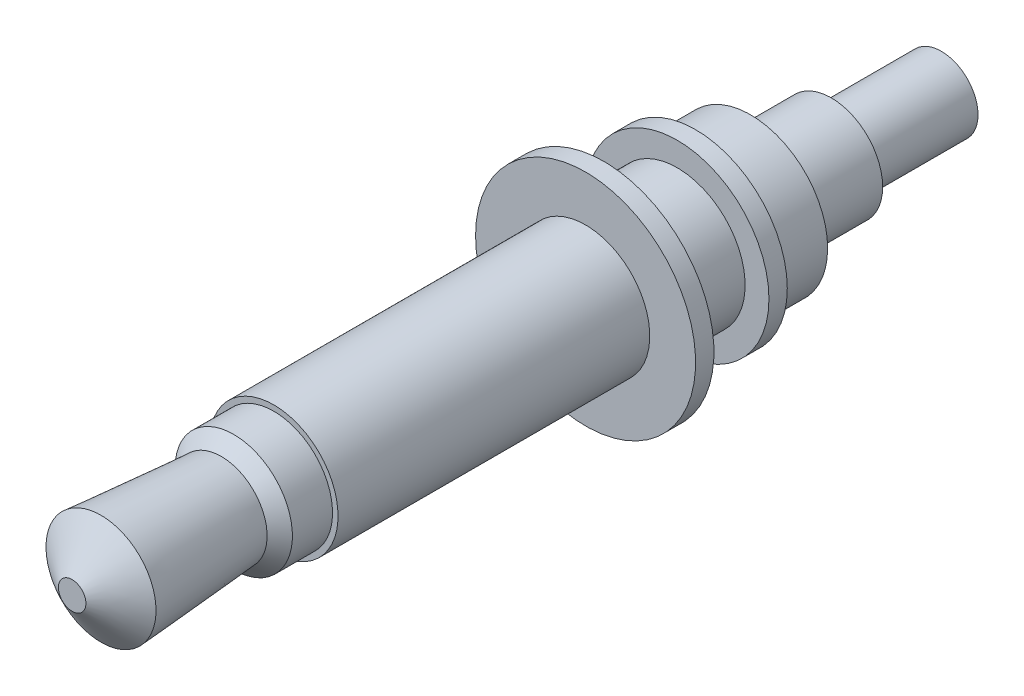
ISO-10303-21;
HEADER;
FILE_DESCRIPTION(('STEP AP214'),'2;1');
FILE_NAME('part.step','',(''),(''),'','','');
FILE_SCHEMA(('AUTOMOTIVE_DESIGN { 1 0 10303 214 1 1 1 1 }'));
ENDSEC;
DATA;
#1=APPLICATION_CONTEXT('core data for automotive mechanical design processes');
#2=APPLICATION_PROTOCOL_DEFINITION('international standard','automotive_design',2000,#1);
#3=PRODUCT_CONTEXT('',#1,'mechanical');
#4=PRODUCT('Part','Part','',(#3));
#5=PRODUCT_RELATED_PRODUCT_CATEGORY('part','',(#4));
#6=PRODUCT_DEFINITION_FORMATION('','',#4);
#7=PRODUCT_DEFINITION_CONTEXT('part definition',#1,'design');
#8=PRODUCT_DEFINITION('design','',#6,#7);
#9=PRODUCT_DEFINITION_SHAPE('','',#8);
#10=(LENGTH_UNIT() NAMED_UNIT(*) SI_UNIT(.MILLI.,.METRE.));
#11=(NAMED_UNIT(*) PLANE_ANGLE_UNIT() SI_UNIT($,.RADIAN.));
#12=(NAMED_UNIT(*) SI_UNIT($,.STERADIAN.) SOLID_ANGLE_UNIT());
#13=UNCERTAINTY_MEASURE_WITH_UNIT(LENGTH_MEASURE(1.E-05),#10,'distance_accuracy_value','');
#14=(GEOMETRIC_REPRESENTATION_CONTEXT(3) GLOBAL_UNCERTAINTY_ASSIGNED_CONTEXT((#13)) GLOBAL_UNIT_ASSIGNED_CONTEXT((#10,
#11,#12)) REPRESENTATION_CONTEXT('',''));
#15=CARTESIAN_POINT('',(0.,0.,0.));
#16=DIRECTION('',(0.,0.,1.));
#17=DIRECTION('',(1.,0.,0.));
#18=AXIS2_PLACEMENT_3D('',#15,#16,#17);
#19=CARTESIAN_POINT('',(-0.209678248509967,-0.580395581371084,46.8096666229695));
#20=DIRECTION('',(0.,0.,-1.));
#21=DIRECTION('',(-1.,0.,0.));
#22=AXIS2_PLACEMENT_3D('',#19,#20,#21);
#23=PLANE('',#22);
#24=CARTESIAN_POINT('',(-0.209678248509966,-0.580395581371085,46.8096666229695));
#25=DIRECTION('',(0.,0.,1.));
#26=DIRECTION('',(1.,0.,0.));
#27=AXIS2_PLACEMENT_3D('',#24,#25,#26);
#28=CIRCLE('',#27,1.);
#29=CARTESIAN_POINT('',(0.790321751490033,-0.580395581371085,46.8096666229695));
#30=VERTEX_POINT('',#29);
#31=EDGE_CURVE('E18',#30,#30,#28,.T.);
#32=ORIENTED_EDGE('',*,*,#31,.F.);
#33=EDGE_LOOP('',(#32));
#34=FACE_BOUND('',#33,.T.);
#35=ADVANCED_FACE('F15',(#34),#23,.T.);
#36=CARTESIAN_POINT('',(-0.209678248509957,-0.580395581371091,42.8498686483249));
#37=DIRECTION('',(0.,0.,1.));
#38=DIRECTION('',(1.,0.,0.));
#39=AXIS2_PLACEMENT_3D('',#36,#37,#38);
#40=CYLINDRICAL_SURFACE('',#39,1.);
#41=ORIENTED_EDGE('',*,*,#31,.T.);
#42=EDGE_LOOP('',(#41));
#43=FACE_BOUND('',#42,.T.);
#44=CARTESIAN_POINT('',(-0.209678248509973,-0.58039558137108,49.8096666229695));
#45=DIRECTION('',(0.,0.,1.));
#46=DIRECTION('',(1.,0.,0.));
#47=AXIS2_PLACEMENT_3D('',#44,#45,#46);
#48=CIRCLE('',#47,1.);
#49=CARTESIAN_POINT('',(0.790321751490026,-0.58039558137108,49.8096666229695));
#50=VERTEX_POINT('',#49);
#51=EDGE_CURVE('E84',#50,#50,#48,.T.);
#52=ORIENTED_EDGE('',*,*,#51,.F.);
#53=EDGE_LOOP('',(#52));
#54=FACE_BOUND('',#53,.T.);
#55=ADVANCED_FACE('F93',(#43,#54),#40,.T.);
#56=CARTESIAN_POINT('',(-0.209678248509974,-0.580395581371081,49.8096666229695));
#57=DIRECTION('',(0.,0.,-1.));
#58=DIRECTION('',(-1.,0.,0.));
#59=AXIS2_PLACEMENT_3D('',#56,#57,#58);
#60=PLANE('',#59);
#61=CARTESIAN_POINT('',(-0.209678248509974,-0.58039558137108,49.8096666229695));
#62=DIRECTION('',(0.,0.,1.));
#63=DIRECTION('',(1.,0.,0.));
#64=AXIS2_PLACEMENT_3D('',#61,#62,#63);
#65=CIRCLE('',#64,1.4);
#66=CARTESIAN_POINT('',(1.19032175149003,-0.58039558137108,49.8096666229695));
#67=VERTEX_POINT('',#66);
#68=EDGE_CURVE('E81',#67,#67,#65,.T.);
#69=ORIENTED_EDGE('',*,*,#68,.F.);
#70=EDGE_LOOP('',(#69));
#71=FACE_BOUND('',#70,.T.);
#72=ORIENTED_EDGE('',*,*,#51,.T.);
#73=EDGE_LOOP('',(#72));
#74=FACE_BOUND('',#73,.T.);
#75=ADVANCED_FACE('F100',(#71,#74),#60,.T.);
#76=CARTESIAN_POINT('',(-0.209678248509953,-0.580395581371095,40.8699696610025));
#77=DIRECTION('',(0.,0.,1.));
#78=DIRECTION('',(1.,0.,0.));
#79=AXIS2_PLACEMENT_3D('',#76,#77,#78);
#80=CYLINDRICAL_SURFACE('',#79,1.4);
#81=ORIENTED_EDGE('',*,*,#68,.T.);
#82=EDGE_LOOP('',(#81));
#83=FACE_BOUND('',#82,.T.);
#84=CARTESIAN_POINT('',(-0.20967824850998,-0.580395581371077,52.0096666229695));
#85=DIRECTION('',(0.,0.,1.));
#86=DIRECTION('',(1.,0.,0.));
#87=AXIS2_PLACEMENT_3D('',#84,#85,#86);
#88=CIRCLE('',#87,1.4);
#89=CARTESIAN_POINT('',(1.19032175149002,-0.580395581371077,52.0096666229695));
#90=VERTEX_POINT('',#89);
#91=EDGE_CURVE('E77',#90,#90,#88,.T.);
#92=ORIENTED_EDGE('',*,*,#91,.F.);
#93=EDGE_LOOP('',(#92));
#94=FACE_BOUND('',#93,.T.);
#95=ADVANCED_FACE('F166',(#83,#94),#80,.T.);
#96=CARTESIAN_POINT('',(-0.20967824850998,-0.580395581371076,52.0096666229695));
#97=DIRECTION('',(0.,0.,-1.));
#98=DIRECTION('',(-1.,0.,0.));
#99=AXIS2_PLACEMENT_3D('',#96,#97,#98);
#100=PLANE('',#99);
#101=CARTESIAN_POINT('',(-0.20967824850998,-0.580395581371076,52.0096666229695));
#102=DIRECTION('',(0.,0.,1.));
#103=DIRECTION('',(1.,0.,0.));
#104=AXIS2_PLACEMENT_3D('',#101,#102,#103);
#105=CIRCLE('',#104,2.1);
#106=CARTESIAN_POINT('',(1.89032175149002,-0.580395581371076,52.0096666229695));
#107=VERTEX_POINT('',#106);
#108=EDGE_CURVE('E73',#107,#107,#105,.T.);
#109=ORIENTED_EDGE('',*,*,#108,.F.);
#110=EDGE_LOOP('',(#109));
#111=FACE_BOUND('',#110,.T.);
#112=ORIENTED_EDGE('',*,*,#91,.T.);
#113=EDGE_LOOP('',(#112));
#114=FACE_BOUND('',#113,.T.);
#115=ADVANCED_FACE('F162',(#111,#114),#100,.T.);
#116=CARTESIAN_POINT('',(-0.20967824850998,-0.580395581371076,52.0096666229695));
#117=DIRECTION('',(0.,0.,1.));
#118=DIRECTION('',(1.,0.,0.));
#119=AXIS2_PLACEMENT_3D('',#116,#117,#118);
#120=CYLINDRICAL_SURFACE('',#119,2.1);
#121=ORIENTED_EDGE('',*,*,#108,.T.);
#122=EDGE_LOOP('',(#121));
#123=FACE_BOUND('',#122,.T.);
#124=CARTESIAN_POINT('',(-0.209678248509983,-0.580395581371073,53.5096666229695));
#125=DIRECTION('',(0.,0.,1.));
#126=DIRECTION('',(1.,0.,0.));
#127=AXIS2_PLACEMENT_3D('',#124,#125,#126);
#128=CIRCLE('',#127,2.1);
#129=CARTESIAN_POINT('',(1.89032175149002,-0.580395581371073,53.5096666229695));
#130=VERTEX_POINT('',#129);
#131=EDGE_CURVE('E70',#130,#130,#128,.T.);
#132=ORIENTED_EDGE('',*,*,#131,.F.);
#133=EDGE_LOOP('',(#132));
#134=FACE_BOUND('',#133,.T.);
#135=ADVANCED_FACE('F158',(#123,#134),#120,.T.);
#136=CARTESIAN_POINT('',(-0.209678248509983,-0.580395581371074,53.5096666229695));
#137=DIRECTION('',(0.,0.,-1.));
#138=DIRECTION('',(-1.,0.,0.));
#139=AXIS2_PLACEMENT_3D('',#136,#137,#138);
#140=PLANE('',#139);
#141=CARTESIAN_POINT('',(-0.209678248509983,-0.580395581371074,53.5096666229695));
#142=DIRECTION('',(0.,0.,1.));
#143=DIRECTION('',(1.,0.,0.));
#144=AXIS2_PLACEMENT_3D('',#141,#142,#143);
#145=CIRCLE('',#144,2.5);
#146=CARTESIAN_POINT('',(2.29032175149002,-0.580395581371074,53.5096666229695));
#147=VERTEX_POINT('',#146);
#148=EDGE_CURVE('E66',#147,#147,#145,.T.);
#149=ORIENTED_EDGE('',*,*,#148,.F.);
#150=EDGE_LOOP('',(#149));
#151=FACE_BOUND('',#150,.T.);
#152=ORIENTED_EDGE('',*,*,#131,.T.);
#153=EDGE_LOOP('',(#152));
#154=FACE_BOUND('',#153,.T.);
#155=ADVANCED_FACE('F154',(#151,#154),#140,.T.);
#156=CARTESIAN_POINT('',(-0.209678248510023,-0.580395581371046,70.5096666229695));
#157=DIRECTION('',(0.,0.,-1.));
#158=DIRECTION('',(-1.,0.,0.));
#159=AXIS2_PLACEMENT_3D('',#156,#157,#158);
#160=PLANE('',#159);
#161=CARTESIAN_POINT('',(-0.209678248510028,-0.580395581371047,70.5096666230587));
#162=DIRECTION('',(0.,0.,-1.));
#163=DIRECTION('',(-1.,0.,0.));
#164=AXIS2_PLACEMENT_3D('',#161,#162,#163);
#165=CIRCLE('',#164,0.374999999953724);
#166=CARTESIAN_POINT('',(-0.584678248463752,-0.580395581371047,70.5096666230587));
#167=VERTEX_POINT('',#166);
#168=EDGE_CURVE('E62',#167,#167,#165,.T.);
#169=ORIENTED_EDGE('',*,*,#168,.F.);
#170=EDGE_LOOP('',(#169));
#171=FACE_BOUND('',#170,.T.);
#172=ADVANCED_FACE('F150',(#171),#160,.F.);
#173=CARTESIAN_POINT('',(-0.209678248509983,-0.580395581371074,53.5096666229695));
#174=DIRECTION('',(0.,0.,1.));
#175=DIRECTION('',(1.,0.,0.));
#176=AXIS2_PLACEMENT_3D('',#173,#174,#175);
#177=CYLINDRICAL_SURFACE('',#176,2.5);
#178=ORIENTED_EDGE('',*,*,#148,.T.);
#179=EDGE_LOOP('',(#178));
#180=FACE_BOUND('',#179,.T.);
#181=CARTESIAN_POINT('',(-0.209678248509984,-0.580395581371073,54.0096666229695));
#182=DIRECTION('',(0.,0.,1.));
#183=DIRECTION('',(1.,0.,0.));
#184=AXIS2_PLACEMENT_3D('',#181,#182,#183);
#185=CIRCLE('',#184,2.5);
#186=CARTESIAN_POINT('',(2.29032175149002,-0.580395581371073,54.0096666229695));
#187=VERTEX_POINT('',#186);
#188=EDGE_CURVE('E58',#187,#187,#185,.F.);
#189=ORIENTED_EDGE('',*,*,#188,.T.);
#190=EDGE_LOOP('',(#189));
#191=FACE_BOUND('',#190,.T.);
#192=ADVANCED_FACE('F146',(#180,#191),#177,.T.);
#193=CARTESIAN_POINT('',(-0.209678248510021,-0.580395581371048,69.7225743310241));
#194=DIRECTION('',(0.,0.,-1.));
#195=DIRECTION('',(-1.,0.,0.));
#196=AXIS2_PLACEMENT_3D('',#193,#194,#195);
#197=CONICAL_SURFACE('',#196,1.49999999982817,0.96031362999525);
#198=ORIENTED_EDGE('',*,*,#168,.T.);
#199=EDGE_LOOP('',(#198));
#200=FACE_BOUND('',#199,.T.);
#201=CARTESIAN_POINT('',(-0.209678248510021,-0.580395581371048,69.7225743309105));
#202=DIRECTION('',(0.,0.,1.));
#203=DIRECTION('',(-0.998392394811248,0.0566800316078043,0.));
#204=AXIS2_PLACEMENT_3D('',#201,#202,#203);
#205=CIRCLE('',#204,1.49999999999118);
#206=CARTESIAN_POINT('',(-1.70726684071809,-0.495375533959841,69.7225743309105));
#207=VERTEX_POINT('',#206);
#208=EDGE_CURVE('E35',#207,#207,#205,.F.);
#209=ORIENTED_EDGE('',*,*,#208,.F.);
#210=EDGE_LOOP('',(#209));
#211=FACE_BOUND('',#210,.T.);
#212=ADVANCED_FACE('F142',(#200,#211),#197,.T.);
#213=CARTESIAN_POINT('',(-0.209678248509985,-0.580395581371074,54.0096666229695));
#214=DIRECTION('',(0.,0.,-1.));
#215=DIRECTION('',(-1.,0.,0.));
#216=AXIS2_PLACEMENT_3D('',#213,#214,#215);
#217=PLANE('',#216);
#218=CARTESIAN_POINT('',(-0.209678248509983,-0.580395581371073,54.0096666229695));
#219=DIRECTION('',(0.,0.,-1.));
#220=DIRECTION('',(-1.,0.,0.));
#221=AXIS2_PLACEMENT_3D('',#218,#219,#220);
#222=CIRCLE('',#221,1.85);
#223=CARTESIAN_POINT('',(-2.05967824850998,-0.580395581371073,54.0096666229695));
#224=VERTEX_POINT('',#223);
#225=EDGE_CURVE('E54',#224,#224,#222,.F.);
#226=ORIENTED_EDGE('',*,*,#225,.F.);
#227=EDGE_LOOP('',(#226));
#228=FACE_BOUND('',#227,.T.);
#229=ORIENTED_EDGE('',*,*,#188,.F.);
#230=EDGE_LOOP('',(#229));
#231=FACE_BOUND('',#230,.T.);
#232=ADVANCED_FACE('F138',(#228,#231),#217,.F.);
#233=CARTESIAN_POINT('',(-0.209678248510021,-0.580395581371048,69.7225743309673));
#234=DIRECTION('',(0.,0.,1.));
#235=DIRECTION('',(1.,0.,0.));
#236=AXIS2_PLACEMENT_3D('',#233,#234,#235);
#237=CONICAL_SURFACE('',#236,1.49999999999828,0.076101137574887);
#238=CARTESIAN_POINT('',(-0.209678248510013,-0.580395581371052,66.4438165323418));
#239=DIRECTION('',(0.,0.,-1.));
#240=DIRECTION('',(0.998392394811258,-0.0566800316076238,0.));
#241=AXIS2_PLACEMENT_3D('',#238,#239,#240);
#242=CIRCLE('',#241,1.24999999998254);
#243=CARTESIAN_POINT('',(1.03831224498663,-0.651245620879592,66.4438165323418));
#244=VERTEX_POINT('',#243);
#245=EDGE_CURVE('E53',#244,#244,#242,.T.);
#246=ORIENTED_EDGE('',*,*,#245,.F.);
#247=EDGE_LOOP('',(#246));
#248=FACE_BOUND('',#247,.T.);
#249=ORIENTED_EDGE('',*,*,#208,.T.);
#250=EDGE_LOOP('',(#249));
#251=FACE_BOUND('',#250,.T.);
#252=ADVANCED_FACE('F134',(#248,#251),#237,.T.);
#253=CARTESIAN_POINT('',(-0.20967824851,-0.580395581371062,61.2422568037499));
#254=DIRECTION('',(0.,0.,-1.));
#255=DIRECTION('',(-1.,0.,0.));
#256=AXIS2_PLACEMENT_3D('',#253,#254,#255);
#257=CYLINDRICAL_SURFACE('',#256,1.85);
#258=ORIENTED_EDGE('',*,*,#225,.T.);
#259=EDGE_LOOP('',(#258));
#260=FACE_BOUND('',#259,.T.);
#261=CARTESIAN_POINT('',(-0.209678248509988,-0.58039558137107,56.0096666229695));
#262=DIRECTION('',(0.,0.,-1.));
#263=DIRECTION('',(-1.,0.,0.));
#264=AXIS2_PLACEMENT_3D('',#261,#262,#263);
#265=CIRCLE('',#264,1.85);
#266=CARTESIAN_POINT('',(-2.05967824850999,-0.58039558137107,56.0096666229695));
#267=VERTEX_POINT('',#266);
#268=EDGE_CURVE('E50',#267,#267,#265,.F.);
#269=ORIENTED_EDGE('',*,*,#268,.F.);
#270=EDGE_LOOP('',(#269));
#271=FACE_BOUND('',#270,.T.);
#272=ADVANCED_FACE('F130',(#260,#271),#257,.T.);
#273=CARTESIAN_POINT('',(-0.209678248510012,-0.580395581371053,66.1039621254531));
#274=DIRECTION('',(0.,0.,-1.));
#275=DIRECTION('',(-1.,0.,0.));
#276=AXIS2_PLACEMENT_3D('',#273,#274,#275);
#277=CONICAL_SURFACE('',#276,1.60000000002812,0.800103964619919);
#278=ORIENTED_EDGE('',*,*,#245,.T.);
#279=EDGE_LOOP('',(#278));
#280=FACE_BOUND('',#279,.T.);
#281=CARTESIAN_POINT('',(-0.209678248510012,-0.580395581371053,66.1039621254695));
#282=DIRECTION('',(0.,0.,-1.));
#283=DIRECTION('',(-1.,0.,0.));
#284=AXIS2_PLACEMENT_3D('',#281,#282,#283);
#285=CIRCLE('',#284,1.6);
#286=CARTESIAN_POINT('',(-1.80967824851001,-0.580395581371053,66.1039621254695));
#287=VERTEX_POINT('',#286);
#288=EDGE_CURVE('E49',#287,#287,#285,.T.);
#289=ORIENTED_EDGE('',*,*,#288,.F.);
#290=EDGE_LOOP('',(#289));
#291=FACE_BOUND('',#290,.T.);
#292=ADVANCED_FACE('F126',(#280,#291),#277,.T.);
#293=CARTESIAN_POINT('',(-0.209678248509988,-0.58039558137107,56.0096666229695));
#294=DIRECTION('',(0.,0.,-1.));
#295=DIRECTION('',(-1.,0.,0.));
#296=AXIS2_PLACEMENT_3D('',#293,#294,#295);
#297=PLANE('',#296);
#298=ORIENTED_EDGE('',*,*,#268,.T.);
#299=EDGE_LOOP('',(#298));
#300=FACE_BOUND('',#299,.T.);
#301=CARTESIAN_POINT('',(-0.209678248509989,-0.580395581371069,56.0096666229695));
#302=DIRECTION('',(0.,0.,-1.));
#303=DIRECTION('',(-1.,0.,0.));
#304=AXIS2_PLACEMENT_3D('',#301,#302,#303);
#305=CIRCLE('',#304,3.);
#306=CARTESIAN_POINT('',(-3.20967824850999,-0.580395581371069,56.0096666229695));
#307=VERTEX_POINT('',#306);
#308=EDGE_CURVE('E45',#307,#307,#305,.F.);
#309=ORIENTED_EDGE('',*,*,#308,.F.);
#310=EDGE_LOOP('',(#309));
#311=FACE_BOUND('',#310,.T.);
#312=ADVANCED_FACE('F122',(#300,#311),#297,.T.);
#313=CARTESIAN_POINT('',(-0.209678248509974,-0.580395581371079,50.0096666229695));
#314=DIRECTION('',(0.,0.,-1.));
#315=DIRECTION('',(-1.,0.,0.));
#316=AXIS2_PLACEMENT_3D('',#313,#314,#315);
#317=CYLINDRICAL_SURFACE('',#316,1.6);
#318=ORIENTED_EDGE('',*,*,#288,.T.);
#319=EDGE_LOOP('',(#318));
#320=FACE_BOUND('',#319,.T.);
#321=CARTESIAN_POINT('',(-0.20967824851001,-0.580395581371055,65.0096666229695));
#322=DIRECTION('',(0.,0.,-1.));
#323=DIRECTION('',(-1.,0.,0.));
#324=AXIS2_PLACEMENT_3D('',#321,#322,#323);
#325=CIRCLE('',#324,1.6);
#326=CARTESIAN_POINT('',(-1.80967824851001,-0.580395581371055,65.0096666229695));
#327=VERTEX_POINT('',#326);
#328=EDGE_CURVE('E41',#327,#327,#325,.F.);
#329=ORIENTED_EDGE('',*,*,#328,.T.);
#330=EDGE_LOOP('',(#329));
#331=FACE_BOUND('',#330,.T.);
#332=ADVANCED_FACE('F118',(#320,#331),#317,.T.);
#333=CARTESIAN_POINT('',(-0.20967824850999,-0.580395581371069,56.5096666229695));
#334=DIRECTION('',(0.,0.,-1.));
#335=DIRECTION('',(-1.,0.,0.));
#336=AXIS2_PLACEMENT_3D('',#333,#334,#335);
#337=CYLINDRICAL_SURFACE('',#336,3.);
#338=ORIENTED_EDGE('',*,*,#308,.T.);
#339=EDGE_LOOP('',(#338));
#340=FACE_BOUND('',#339,.T.);
#341=CARTESIAN_POINT('',(-0.20967824850999,-0.580395581371069,56.5096666229695));
#342=DIRECTION('',(0.,0.,-1.));
#343=DIRECTION('',(-1.,0.,0.));
#344=AXIS2_PLACEMENT_3D('',#341,#342,#343);
#345=CIRCLE('',#344,3.);
#346=CARTESIAN_POINT('',(-3.20967824850999,-0.580395581371069,56.5096666229695));
#347=VERTEX_POINT('',#346);
#348=EDGE_CURVE('E32',#347,#347,#345,.T.);
#349=ORIENTED_EDGE('',*,*,#348,.T.);
#350=EDGE_LOOP('',(#349));
#351=FACE_BOUND('',#350,.T.);
#352=ADVANCED_FACE('F114',(#340,#351),#337,.T.);
#353=CARTESIAN_POINT('',(-0.118990197938054,1.01703225032697,65.0096666229695));
#354=DIRECTION('',(0.,0.,-1.));
#355=DIRECTION('',(-1.,0.,0.));
#356=AXIS2_PLACEMENT_3D('',#353,#354,#355);
#357=PLANE('',#356);
#358=ORIENTED_EDGE('',*,*,#328,.F.);
#359=EDGE_LOOP('',(#358));
#360=FACE_BOUND('',#359,.T.);
#361=CARTESIAN_POINT('',(-0.20967824851001,-0.580395581371055,65.0096666229695));
#362=DIRECTION('',(0.,0.,-1.));
#363=DIRECTION('',(-1.,0.,0.));
#364=AXIS2_PLACEMENT_3D('',#361,#362,#363);
#365=CIRCLE('',#364,1.75);
#366=CARTESIAN_POINT('',(-1.95967824851001,-0.580395581371055,65.0096666229695));
#367=VERTEX_POINT('',#366);
#368=EDGE_CURVE('E23',#367,#367,#365,.T.);
#369=ORIENTED_EDGE('',*,*,#368,.F.);
#370=EDGE_LOOP('',(#369));
#371=FACE_BOUND('',#370,.T.);
#372=ADVANCED_FACE('F107',(#360,#371),#357,.F.);
#373=CARTESIAN_POINT('',(-0.110488193196912,1.16679110954865,56.5096666229695));
#374=DIRECTION('',(0.,0.,-1.));
#375=DIRECTION('',(-1.,0.,0.));
#376=AXIS2_PLACEMENT_3D('',#373,#374,#375);
#377=PLANE('',#376);
#378=CARTESIAN_POINT('',(-0.209678248509989,-0.580395581371068,56.5096666229695));
#379=DIRECTION('',(0.,0.,-1.));
#380=DIRECTION('',(-1.,0.,0.));
#381=AXIS2_PLACEMENT_3D('',#378,#379,#380);
#382=CIRCLE('',#381,1.75);
#383=CARTESIAN_POINT('',(-1.95967824850999,-0.580395581371068,56.5096666229695));
#384=VERTEX_POINT('',#383);
#385=EDGE_CURVE('E10',#384,#384,#382,.F.);
#386=ORIENTED_EDGE('',*,*,#385,.F.);
#387=EDGE_LOOP('',(#386));
#388=FACE_BOUND('',#387,.T.);
#389=ORIENTED_EDGE('',*,*,#348,.F.);
#390=EDGE_LOOP('',(#389));
#391=FACE_BOUND('',#390,.T.);
#392=ADVANCED_FACE('F103',(#388,#391),#377,.F.);
#393=CARTESIAN_POINT('',(-0.209678248509974,-0.580395581371079,50.0096666229695));
#394=DIRECTION('',(0.,0.,-1.));
#395=DIRECTION('',(-1.,0.,0.));
#396=AXIS2_PLACEMENT_3D('',#393,#394,#395);
#397=CYLINDRICAL_SURFACE('',#396,1.75);
#398=ORIENTED_EDGE('',*,*,#385,.T.);
#399=EDGE_LOOP('',(#398));
#400=FACE_BOUND('',#399,.T.);
#401=ORIENTED_EDGE('',*,*,#368,.T.);
#402=EDGE_LOOP('',(#401));
#403=FACE_BOUND('',#402,.T.);
#404=ADVANCED_FACE('F101',(#400,#403),#397,.T.);
#405=CLOSED_SHELL('',(#35,#55,#75,#95,#115,#135,#155,#172,#192,#212,#232,#252,#272,#292,#312,
#332,#352,#372,#392,#404));
#406=MANIFOLD_SOLID_BREP('B1',#405);
#407=ADVANCED_BREP_SHAPE_REPRESENTATION('',(#18,#406),#14);
#408=SHAPE_DEFINITION_REPRESENTATION(#9,#407);
ENDSEC;
END-ISO-10303-21;
